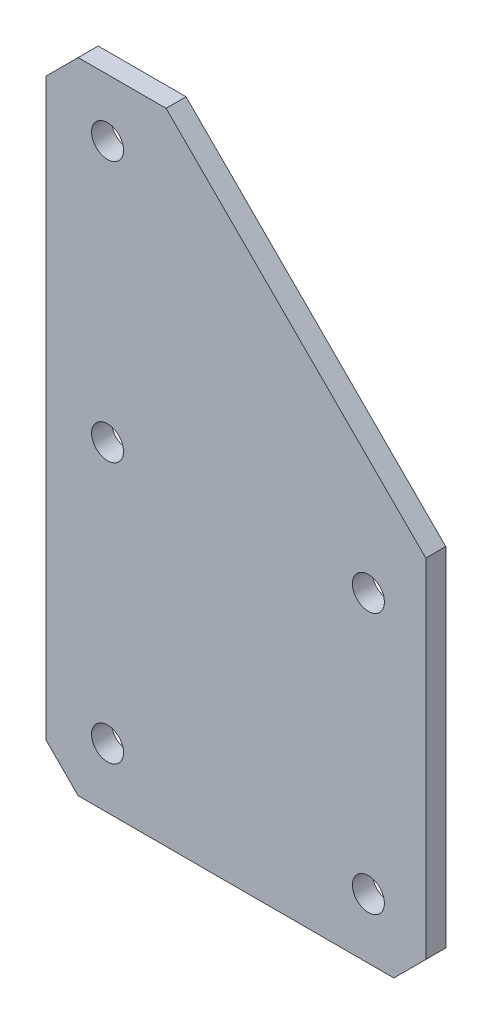
ISO-10303-21;
HEADER;
FILE_DESCRIPTION(('STEP AP214'),'2;1');
FILE_NAME('part.step','',(''),(''),'','','');
FILE_SCHEMA(('AUTOMOTIVE_DESIGN { 1 0 10303 214 1 1 1 1 }'));
ENDSEC;
DATA;
#1=APPLICATION_CONTEXT('core data for automotive mechanical design processes');
#2=APPLICATION_PROTOCOL_DEFINITION('international standard','automotive_design',2000,#1);
#3=PRODUCT_CONTEXT('',#1,'mechanical');
#4=PRODUCT('Part','Part','',(#3));
#5=PRODUCT_RELATED_PRODUCT_CATEGORY('part','',(#4));
#6=PRODUCT_DEFINITION_FORMATION('','',#4);
#7=PRODUCT_DEFINITION_CONTEXT('part definition',#1,'design');
#8=PRODUCT_DEFINITION('design','',#6,#7);
#9=PRODUCT_DEFINITION_SHAPE('','',#8);
#10=(LENGTH_UNIT() NAMED_UNIT(*) SI_UNIT(.MILLI.,.METRE.));
#11=(NAMED_UNIT(*) PLANE_ANGLE_UNIT() SI_UNIT($,.RADIAN.));
#12=(NAMED_UNIT(*) SI_UNIT($,.STERADIAN.) SOLID_ANGLE_UNIT());
#13=UNCERTAINTY_MEASURE_WITH_UNIT(LENGTH_MEASURE(1.E-05),#10,'distance_accuracy_value','');
#14=(GEOMETRIC_REPRESENTATION_CONTEXT(3) GLOBAL_UNCERTAINTY_ASSIGNED_CONTEXT((#13)) GLOBAL_UNIT_ASSIGNED_CONTEXT((#10,
#11,#12)) REPRESENTATION_CONTEXT('',''));
#15=CARTESIAN_POINT('',(0.,0.,0.));
#16=DIRECTION('',(0.,0.,1.));
#17=DIRECTION('',(1.,0.,0.));
#18=AXIS2_PLACEMENT_3D('',#15,#16,#17);
#19=CARTESIAN_POINT('',(-95.3643561974927,112.075976437154,3.175));
#20=DIRECTION('',(1.,0.,0.));
#21=DIRECTION('',(0.,0.,-1.));
#22=AXIS2_PLACEMENT_3D('',#19,#20,#21);
#23=PLANE('',#22);
#24=DIRECTION('',(0.,-1.,0.));
#25=VECTOR('',#24,1.);
#26=CARTESIAN_POINT('',(-95.3643561974927,112.075976437154,3.175));
#27=LINE('',#26,#25);
#28=CARTESIAN_POINT('',(-95.3643561974927,106.995976437154,3.175));
#29=VERTEX_POINT('',#28);
#30=CARTESIAN_POINT('',(-95.3643561974927,15.5559764371544,3.175));
#31=VERTEX_POINT('',#30);
#32=EDGE_CURVE('E166',#29,#31,#27,.T.);
#33=ORIENTED_EDGE('',*,*,#32,.F.);
#34=DIRECTION('',(0.,0.,-1.));
#35=VECTOR('',#34,1.);
#36=CARTESIAN_POINT('',(-95.3643561974927,106.995976437154,3.175));
#37=LINE('',#36,#35);
#38=CARTESIAN_POINT('',(-95.3643561974927,106.995976437154,0.));
#39=VERTEX_POINT('',#38);
#40=EDGE_CURVE('E170',#29,#39,#37,.T.);
#41=ORIENTED_EDGE('',*,*,#40,.T.);
#42=DIRECTION('',(0.,-1.,0.));
#43=VECTOR('',#42,1.);
#44=CARTESIAN_POINT('',(-95.3643561974927,112.075976437154,0.));
#45=LINE('',#44,#43);
#46=CARTESIAN_POINT('',(-95.3643561974927,15.5559764371544,0.));
#47=VERTEX_POINT('',#46);
#48=EDGE_CURVE('E150',#39,#47,#45,.T.);
#49=ORIENTED_EDGE('',*,*,#48,.T.);
#50=DIRECTION('',(0.,0.,1.));
#51=VECTOR('',#50,1.);
#52=CARTESIAN_POINT('',(-95.3643561974927,15.5559764371544,3.175));
#53=LINE('',#52,#51);
#54=EDGE_CURVE('E136',#47,#31,#53,.T.);
#55=ORIENTED_EDGE('',*,*,#54,.T.);
#56=EDGE_LOOP('',(#33,#41,#49,#55));
#57=FACE_BOUND('',#56,.T.);
#58=ADVANCED_FACE('F39',(#57),#23,.F.);
#59=CARTESIAN_POINT('',(-95.3643561974927,10.4759764371543,3.175));
#60=DIRECTION('',(0.,1.,0.));
#61=DIRECTION('',(0.,0.,1.));
#62=AXIS2_PLACEMENT_3D('',#59,#60,#61);
#63=PLANE('',#62);
#64=DIRECTION('',(1.,0.,0.));
#65=VECTOR('',#64,1.);
#66=CARTESIAN_POINT('',(-95.3643561974927,10.4759764371543,3.175));
#67=LINE('',#66,#65);
#68=CARTESIAN_POINT('',(-90.2843561974927,10.4759764371543,3.175));
#69=VERTEX_POINT('',#68);
#70=CARTESIAN_POINT('',(-40.1193561974927,10.4759764371543,3.175));
#71=VERTEX_POINT('',#70);
#72=EDGE_CURVE('E126',#69,#71,#67,.T.);
#73=ORIENTED_EDGE('',*,*,#72,.F.);
#74=DIRECTION('',(0.,0.,-1.));
#75=VECTOR('',#74,1.);
#76=CARTESIAN_POINT('',(-90.2843561974927,10.4759764371543,3.175));
#77=LINE('',#76,#75);
#78=CARTESIAN_POINT('',(-90.2843561974927,10.4759764371543,0.));
#79=VERTEX_POINT('',#78);
#80=EDGE_CURVE('E48',#69,#79,#77,.T.);
#81=ORIENTED_EDGE('',*,*,#80,.T.);
#82=DIRECTION('',(1.,0.,0.));
#83=VECTOR('',#82,1.);
#84=CARTESIAN_POINT('',(-95.3643561974927,10.4759764371543,0.));
#85=LINE('',#84,#83);
#86=CARTESIAN_POINT('',(-40.1193561974927,10.4759764371543,0.));
#87=VERTEX_POINT('',#86);
#88=EDGE_CURVE('E154',#79,#87,#85,.T.);
#89=ORIENTED_EDGE('',*,*,#88,.T.);
#90=DIRECTION('',(0.,0.,1.));
#91=VECTOR('',#90,1.);
#92=CARTESIAN_POINT('',(-40.1193561974927,10.4759764371543,3.175));
#93=LINE('',#92,#91);
#94=EDGE_CURVE('E68',#87,#71,#93,.T.);
#95=ORIENTED_EDGE('',*,*,#94,.T.);
#96=EDGE_LOOP('',(#73,#81,#89,#95));
#97=FACE_BOUND('',#96,.T.);
#98=ADVANCED_FACE('F196',(#97),#63,.F.);
#99=CARTESIAN_POINT('',(-35.0393561974927,70.8009764371544,3.175));
#100=DIRECTION('',(-1.,0.,0.));
#101=DIRECTION('',(0.,0.,1.));
#102=AXIS2_PLACEMENT_3D('',#99,#100,#101);
#103=PLANE('',#102);
#104=DIRECTION('',(0.,1.,0.));
#105=VECTOR('',#104,1.);
#106=CARTESIAN_POINT('',(-35.0393561974927,70.8009764371544,3.175));
#107=LINE('',#106,#105);
#108=CARTESIAN_POINT('',(-35.0393561974927,15.5559764371543,3.175));
#109=VERTEX_POINT('',#108);
#110=CARTESIAN_POINT('',(-35.0393561974927,70.8009764371544,3.175));
#111=VERTEX_POINT('',#110);
#112=EDGE_CURVE('E116',#109,#111,#107,.T.);
#113=ORIENTED_EDGE('',*,*,#112,.F.);
#114=DIRECTION('',(0.,0.,-1.));
#115=VECTOR('',#114,1.);
#116=CARTESIAN_POINT('',(-35.0393561974927,15.5559764371543,3.175));
#117=LINE('',#116,#115);
#118=CARTESIAN_POINT('',(-35.0393561974927,15.5559764371543,0.));
#119=VERTEX_POINT('',#118);
#120=EDGE_CURVE('E11',#109,#119,#117,.T.);
#121=ORIENTED_EDGE('',*,*,#120,.T.);
#122=DIRECTION('',(0.,1.,0.));
#123=VECTOR('',#122,1.);
#124=CARTESIAN_POINT('',(-35.0393561974927,70.8009764371544,0.));
#125=LINE('',#124,#123);
#126=CARTESIAN_POINT('',(-35.0393561974927,70.8009764371544,0.));
#127=VERTEX_POINT('',#126);
#128=EDGE_CURVE('E132',#119,#127,#125,.T.);
#129=ORIENTED_EDGE('',*,*,#128,.T.);
#130=DIRECTION('',(0.,0.,-1.));
#131=VECTOR('',#130,1.);
#132=CARTESIAN_POINT('',(-35.0393561974927,70.8009764371544,3.175));
#133=LINE('',#132,#131);
#134=EDGE_CURVE('E129',#111,#127,#133,.T.);
#135=ORIENTED_EDGE('',*,*,#134,.F.);
#136=EDGE_LOOP('',(#113,#121,#129,#135));
#137=FACE_BOUND('',#136,.T.);
#138=ADVANCED_FACE('F130',(#137),#103,.F.);
#139=CARTESIAN_POINT('',(-35.0393561974927,70.8009764371544,3.175));
#140=DIRECTION('',(-0.707106781186547,-0.707106781186548,0.));
#141=DIRECTION('',(0.707106781186548,-0.707106781186547,0.));
#142=AXIS2_PLACEMENT_3D('',#139,#140,#141);
#143=PLANE('',#142);
#144=DIRECTION('',(-0.707106781186548,0.707106781186548,0.));
#145=VECTOR('',#144,1.);
#146=CARTESIAN_POINT('',(-35.0393561974927,70.8009764371544,0.));
#147=LINE('',#146,#145);
#148=CARTESIAN_POINT('',(-76.3143561974927,112.075976437154,0.));
#149=VERTEX_POINT('',#148);
#150=EDGE_CURVE('E160',#127,#149,#147,.T.);
#151=ORIENTED_EDGE('',*,*,#150,.T.);
#152=DIRECTION('',(0.,0.,-1.));
#153=VECTOR('',#152,1.);
#154=CARTESIAN_POINT('',(-76.3143561974927,112.075976437154,3.175));
#155=LINE('',#154,#153);
#156=CARTESIAN_POINT('',(-76.3143561974927,112.075976437154,3.175));
#157=VERTEX_POINT('',#156);
#158=EDGE_CURVE('E137',#157,#149,#155,.T.);
#159=ORIENTED_EDGE('',*,*,#158,.F.);
#160=DIRECTION('',(-0.707106781186548,0.707106781186548,0.));
#161=VECTOR('',#160,1.);
#162=CARTESIAN_POINT('',(-35.0393561974927,70.8009764371544,3.175));
#163=LINE('',#162,#161);
#164=EDGE_CURVE('E121',#111,#157,#163,.T.);
#165=ORIENTED_EDGE('',*,*,#164,.F.);
#166=ORIENTED_EDGE('',*,*,#134,.T.);
#167=EDGE_LOOP('',(#151,#159,#165,#166));
#168=FACE_BOUND('',#167,.T.);
#169=ADVANCED_FACE('F139',(#168),#143,.F.);
#170=CARTESIAN_POINT('',(-95.3643561974927,112.075976437154,3.175));
#171=DIRECTION('',(0.,-1.,0.));
#172=DIRECTION('',(0.,0.,-1.));
#173=AXIS2_PLACEMENT_3D('',#170,#171,#172);
#174=PLANE('',#173);
#175=DIRECTION('',(-1.,0.,0.));
#176=VECTOR('',#175,1.);
#177=CARTESIAN_POINT('',(-95.3643561974927,112.075976437154,0.));
#178=LINE('',#177,#176);
#179=CARTESIAN_POINT('',(-90.2843561974927,112.075976437154,0.));
#180=VERTEX_POINT('',#179);
#181=EDGE_CURVE('E162',#149,#180,#178,.T.);
#182=ORIENTED_EDGE('',*,*,#181,.T.);
#183=DIRECTION('',(0.,0.,1.));
#184=VECTOR('',#183,1.);
#185=CARTESIAN_POINT('',(-90.2843561974927,112.075976437154,3.175));
#186=LINE('',#185,#184);
#187=CARTESIAN_POINT('',(-90.2843561974927,112.075976437154,3.175));
#188=VERTEX_POINT('',#187);
#189=EDGE_CURVE('E182',#180,#188,#186,.T.);
#190=ORIENTED_EDGE('',*,*,#189,.T.);
#191=DIRECTION('',(-1.,0.,0.));
#192=VECTOR('',#191,1.);
#193=CARTESIAN_POINT('',(-95.3643561974927,112.075976437154,3.175));
#194=LINE('',#193,#192);
#195=EDGE_CURVE('E143',#157,#188,#194,.T.);
#196=ORIENTED_EDGE('',*,*,#195,.F.);
#197=ORIENTED_EDGE('',*,*,#158,.T.);
#198=EDGE_LOOP('',(#182,#190,#196,#197));
#199=FACE_BOUND('',#198,.T.);
#200=ADVANCED_FACE('F307',(#199),#174,.F.);
#201=CARTESIAN_POINT('',(0.,0.,3.175));
#202=DIRECTION('',(0.,0.,1.));
#203=DIRECTION('',(1.,0.,0.));
#204=AXIS2_PLACEMENT_3D('',#201,#202,#203);
#205=PLANE('',#204);
#206=CARTESIAN_POINT('',(-44.1627342757908,61.4553628301755,3.175));
#207=DIRECTION('',(0.,0.,-1.));
#208=DIRECTION('',(-1.,0.,0.));
#209=AXIS2_PLACEMENT_3D('',#206,#207,#208);
#210=CIRCLE('',#209,2.54);
#211=CARTESIAN_POINT('',(-46.7027342757908,61.4553628301755,3.175));
#212=VERTEX_POINT('',#211);
#213=EDGE_CURVE('E263',#212,#212,#210,.T.);
#214=ORIENTED_EDGE('',*,*,#213,.T.);
#215=EDGE_LOOP('',(#214));
#216=FACE_BOUND('',#215,.T.);
#217=CARTESIAN_POINT('',(-85.617120668812,102.909749223197,3.175));
#218=DIRECTION('',(0.,0.,-1.));
#219=DIRECTION('',(-1.,0.,0.));
#220=AXIS2_PLACEMENT_3D('',#217,#218,#219);
#221=CIRCLE('',#220,2.53999999999999);
#222=CARTESIAN_POINT('',(-88.157120668812,102.909749223197,3.175));
#223=VERTEX_POINT('',#222);
#224=EDGE_CURVE('E251',#223,#223,#221,.T.);
#225=ORIENTED_EDGE('',*,*,#224,.T.);
#226=EDGE_LOOP('',(#225));
#227=FACE_BOUND('',#226,.T.);
#228=CARTESIAN_POINT('',(-85.617120668812,61.4553628301755,3.175));
#229=DIRECTION('',(0.,0.,-1.));
#230=DIRECTION('',(-1.,0.,0.));
#231=AXIS2_PLACEMENT_3D('',#228,#229,#230);
#232=CIRCLE('',#231,2.54);
#233=CARTESIAN_POINT('',(-88.157120668812,61.4553628301755,3.175));
#234=VERTEX_POINT('',#233);
#235=EDGE_CURVE('E250',#234,#234,#232,.T.);
#236=ORIENTED_EDGE('',*,*,#235,.T.);
#237=EDGE_LOOP('',(#236));
#238=FACE_BOUND('',#237,.T.);
#239=CARTESIAN_POINT('',(-85.617120668812,20.0009764371543,3.175));
#240=DIRECTION('',(0.,0.,-1.));
#241=DIRECTION('',(-1.,0.,0.));
#242=AXIS2_PLACEMENT_3D('',#239,#240,#241);
#243=CIRCLE('',#242,2.54);
#244=CARTESIAN_POINT('',(-88.157120668812,20.0009764371543,3.175));
#245=VERTEX_POINT('',#244);
#246=EDGE_CURVE('E242',#245,#245,#243,.T.);
#247=ORIENTED_EDGE('',*,*,#246,.T.);
#248=EDGE_LOOP('',(#247));
#249=FACE_BOUND('',#248,.T.);
#250=CARTESIAN_POINT('',(-44.1627342757908,20.0009764371543,3.175));
#251=DIRECTION('',(0.,0.,-1.));
#252=DIRECTION('',(-1.,0.,0.));
#253=AXIS2_PLACEMENT_3D('',#250,#251,#252);
#254=CIRCLE('',#253,2.54);
#255=CARTESIAN_POINT('',(-46.7027342757908,20.0009764371543,3.175));
#256=VERTEX_POINT('',#255);
#257=EDGE_CURVE('E155',#256,#256,#254,.T.);
#258=ORIENTED_EDGE('',*,*,#257,.T.);
#259=EDGE_LOOP('',(#258));
#260=FACE_BOUND('',#259,.T.);
#261=ORIENTED_EDGE('',*,*,#195,.T.);
#262=DIRECTION('',(0.707106781186549,0.707106781186547,0.));
#263=VECTOR('',#262,1.);
#264=CARTESIAN_POINT('',(-101.180166317323,101.180166317324,3.175));
#265=LINE('',#264,#263);
#266=EDGE_CURVE('E189',#188,#29,#265,.F.);
#267=ORIENTED_EDGE('',*,*,#266,.T.);
#268=ORIENTED_EDGE('',*,*,#32,.T.);
#269=DIRECTION('',(-0.707106781186546,0.707106781186549,0.));
#270=VECTOR('',#269,1.);
#271=CARTESIAN_POINT('',(-39.9041898801693,-39.9041898801692,3.175));
#272=LINE('',#271,#270);
#273=EDGE_CURVE('E187',#31,#69,#272,.F.);
#274=ORIENTED_EDGE('',*,*,#273,.T.);
#275=ORIENTED_EDGE('',*,*,#72,.T.);
#276=DIRECTION('',(-0.707106781186548,-0.707106781186547,0.));
#277=VECTOR('',#276,1.);
#278=CARTESIAN_POINT('',(-25.2976663173235,25.2976663173235,3.175));
#279=LINE('',#278,#277);
#280=EDGE_CURVE('E58',#71,#109,#279,.F.);
#281=ORIENTED_EDGE('',*,*,#280,.T.);
#282=ORIENTED_EDGE('',*,*,#112,.T.);
#283=ORIENTED_EDGE('',*,*,#164,.T.);
#284=EDGE_LOOP('',(#261,#267,#268,#274,#275,#281,#282,#283));
#285=FACE_BOUND('',#284,.T.);
#286=ADVANCED_FACE('F119',(#216,#227,#238,#249,#260,#285),#205,.T.);
#287=CARTESIAN_POINT('',(0.,0.,0.));
#288=DIRECTION('',(0.,0.,1.));
#289=DIRECTION('',(1.,0.,0.));
#290=AXIS2_PLACEMENT_3D('',#287,#288,#289);
#291=PLANE('',#290);
#292=CARTESIAN_POINT('',(-44.1627342757908,61.4553628301755,0.));
#293=DIRECTION('',(0.,0.,-1.));
#294=DIRECTION('',(-1.,0.,0.));
#295=AXIS2_PLACEMENT_3D('',#292,#293,#294);
#296=CIRCLE('',#295,2.54);
#297=CARTESIAN_POINT('',(-46.7027342757908,61.4553628301755,0.));
#298=VERTEX_POINT('',#297);
#299=EDGE_CURVE('E260',#298,#298,#296,.T.);
#300=ORIENTED_EDGE('',*,*,#299,.F.);
#301=EDGE_LOOP('',(#300));
#302=FACE_BOUND('',#301,.T.);
#303=CARTESIAN_POINT('',(-85.617120668812,102.909749223197,0.));
#304=DIRECTION('',(0.,0.,-1.));
#305=DIRECTION('',(-1.,0.,0.));
#306=AXIS2_PLACEMENT_3D('',#303,#304,#305);
#307=CIRCLE('',#306,2.53999999999999);
#308=CARTESIAN_POINT('',(-88.157120668812,102.909749223197,0.));
#309=VERTEX_POINT('',#308);
#310=EDGE_CURVE('E267',#309,#309,#307,.T.);
#311=ORIENTED_EDGE('',*,*,#310,.F.);
#312=EDGE_LOOP('',(#311));
#313=FACE_BOUND('',#312,.T.);
#314=CARTESIAN_POINT('',(-85.617120668812,61.4553628301755,0.));
#315=DIRECTION('',(0.,0.,-1.));
#316=DIRECTION('',(-1.,0.,0.));
#317=AXIS2_PLACEMENT_3D('',#314,#315,#316);
#318=CIRCLE('',#317,2.54);
#319=CARTESIAN_POINT('',(-88.157120668812,61.4553628301755,0.));
#320=VERTEX_POINT('',#319);
#321=EDGE_CURVE('E246',#320,#320,#318,.T.);
#322=ORIENTED_EDGE('',*,*,#321,.F.);
#323=EDGE_LOOP('',(#322));
#324=FACE_BOUND('',#323,.T.);
#325=CARTESIAN_POINT('',(-85.617120668812,20.0009764371543,0.));
#326=DIRECTION('',(0.,0.,-1.));
#327=DIRECTION('',(-1.,0.,0.));
#328=AXIS2_PLACEMENT_3D('',#325,#326,#327);
#329=CIRCLE('',#328,2.54);
#330=CARTESIAN_POINT('',(-88.157120668812,20.0009764371543,0.));
#331=VERTEX_POINT('',#330);
#332=EDGE_CURVE('E255',#331,#331,#329,.T.);
#333=ORIENTED_EDGE('',*,*,#332,.F.);
#334=EDGE_LOOP('',(#333));
#335=FACE_BOUND('',#334,.T.);
#336=CARTESIAN_POINT('',(-44.1627342757908,20.0009764371543,0.));
#337=DIRECTION('',(0.,0.,-1.));
#338=DIRECTION('',(-1.,0.,0.));
#339=AXIS2_PLACEMENT_3D('',#336,#337,#338);
#340=CIRCLE('',#339,2.54);
#341=CARTESIAN_POINT('',(-46.7027342757908,20.0009764371543,0.));
#342=VERTEX_POINT('',#341);
#343=EDGE_CURVE('E238',#342,#342,#340,.T.);
#344=ORIENTED_EDGE('',*,*,#343,.F.);
#345=EDGE_LOOP('',(#344));
#346=FACE_BOUND('',#345,.T.);
#347=ORIENTED_EDGE('',*,*,#48,.F.);
#348=DIRECTION('',(-0.707106781186549,-0.707106781186547,0.));
#349=VECTOR('',#348,1.);
#350=CARTESIAN_POINT('',(-95.3643561974927,106.995976437154,0.));
#351=LINE('',#350,#349);
#352=EDGE_CURVE('E179',#39,#180,#351,.F.);
#353=ORIENTED_EDGE('',*,*,#352,.T.);
#354=ORIENTED_EDGE('',*,*,#181,.F.);
#355=ORIENTED_EDGE('',*,*,#150,.F.);
#356=ORIENTED_EDGE('',*,*,#128,.F.);
#357=DIRECTION('',(0.707106781186548,0.707106781186547,0.));
#358=VECTOR('',#357,1.);
#359=CARTESIAN_POINT('',(-35.0393561974927,15.5559764371543,0.));
#360=LINE('',#359,#358);
#361=EDGE_CURVE('E174',#119,#87,#360,.F.);
#362=ORIENTED_EDGE('',*,*,#361,.T.);
#363=ORIENTED_EDGE('',*,*,#88,.F.);
#364=DIRECTION('',(0.707106781186546,-0.707106781186549,0.));
#365=VECTOR('',#364,1.);
#366=CARTESIAN_POINT('',(-90.2843561974927,10.4759764371543,0.));
#367=LINE('',#366,#365);
#368=EDGE_CURVE('E177',#79,#47,#367,.F.);
#369=ORIENTED_EDGE('',*,*,#368,.T.);
#370=EDGE_LOOP('',(#347,#353,#354,#355,#356,#362,#363,#369));
#371=FACE_BOUND('',#370,.T.);
#372=ADVANCED_FACE('F201',(#302,#313,#324,#335,#346,#371),#291,.F.);
#373=CARTESIAN_POINT('',(-44.1627342757908,20.0009764371543,3.175));
#374=DIRECTION('',(0.,0.,-1.));
#375=DIRECTION('',(-1.,0.,0.));
#376=AXIS2_PLACEMENT_3D('',#373,#374,#375);
#377=CYLINDRICAL_SURFACE('',#376,2.54);
#378=ORIENTED_EDGE('',*,*,#257,.F.);
#379=EDGE_LOOP('',(#378));
#380=FACE_BOUND('',#379,.T.);
#381=ORIENTED_EDGE('',*,*,#343,.T.);
#382=EDGE_LOOP('',(#381));
#383=FACE_BOUND('',#382,.T.);
#384=ADVANCED_FACE('F285',(#380,#383),#377,.F.);
#385=CARTESIAN_POINT('',(-85.617120668812,20.0009764371543,3.175));
#386=DIRECTION('',(0.,0.,-1.));
#387=DIRECTION('',(-1.,0.,0.));
#388=AXIS2_PLACEMENT_3D('',#385,#386,#387);
#389=CYLINDRICAL_SURFACE('',#388,2.54);
#390=ORIENTED_EDGE('',*,*,#246,.F.);
#391=EDGE_LOOP('',(#390));
#392=FACE_BOUND('',#391,.T.);
#393=ORIENTED_EDGE('',*,*,#332,.T.);
#394=EDGE_LOOP('',(#393));
#395=FACE_BOUND('',#394,.T.);
#396=ADVANCED_FACE('F295',(#392,#395),#389,.F.);
#397=CARTESIAN_POINT('',(-85.617120668812,61.4553628301755,3.175));
#398=DIRECTION('',(0.,0.,-1.));
#399=DIRECTION('',(-1.,0.,0.));
#400=AXIS2_PLACEMENT_3D('',#397,#398,#399);
#401=CYLINDRICAL_SURFACE('',#400,2.54);
#402=ORIENTED_EDGE('',*,*,#235,.F.);
#403=EDGE_LOOP('',(#402));
#404=FACE_BOUND('',#403,.T.);
#405=ORIENTED_EDGE('',*,*,#321,.T.);
#406=EDGE_LOOP('',(#405));
#407=FACE_BOUND('',#406,.T.);
#408=ADVANCED_FACE('F279',(#404,#407),#401,.F.);
#409=CARTESIAN_POINT('',(-85.617120668812,102.909749223197,3.175));
#410=DIRECTION('',(0.,0.,-1.));
#411=DIRECTION('',(-1.,0.,0.));
#412=AXIS2_PLACEMENT_3D('',#409,#410,#411);
#413=CYLINDRICAL_SURFACE('',#412,2.53999999999999);
#414=ORIENTED_EDGE('',*,*,#224,.F.);
#415=EDGE_LOOP('',(#414));
#416=FACE_BOUND('',#415,.T.);
#417=ORIENTED_EDGE('',*,*,#310,.T.);
#418=EDGE_LOOP('',(#417));
#419=FACE_BOUND('',#418,.T.);
#420=ADVANCED_FACE('F225',(#416,#419),#413,.F.);
#421=CARTESIAN_POINT('',(-44.1627342757908,61.4553628301755,3.175));
#422=DIRECTION('',(0.,0.,-1.));
#423=DIRECTION('',(-1.,0.,0.));
#424=AXIS2_PLACEMENT_3D('',#421,#422,#423);
#425=CYLINDRICAL_SURFACE('',#424,2.54);
#426=ORIENTED_EDGE('',*,*,#213,.F.);
#427=EDGE_LOOP('',(#426));
#428=FACE_BOUND('',#427,.T.);
#429=ORIENTED_EDGE('',*,*,#299,.T.);
#430=EDGE_LOOP('',(#429));
#431=FACE_BOUND('',#430,.T.);
#432=ADVANCED_FACE('F220',(#428,#431),#425,.F.);
#433=CARTESIAN_POINT('',(-95.3643561974927,106.995976437154,3.175));
#434=DIRECTION('',(0.707106781186546,-0.707106781186548,0.));
#435=DIRECTION('',(0.,0.,-1.));
#436=AXIS2_PLACEMENT_3D('',#433,#434,#435);
#437=PLANE('',#436);
#438=ORIENTED_EDGE('',*,*,#266,.F.);
#439=ORIENTED_EDGE('',*,*,#189,.F.);
#440=ORIENTED_EDGE('',*,*,#352,.F.);
#441=ORIENTED_EDGE('',*,*,#40,.F.);
#442=EDGE_LOOP('',(#438,#439,#440,#441));
#443=FACE_BOUND('',#442,.T.);
#444=ADVANCED_FACE('F208',(#443),#437,.F.);
#445=CARTESIAN_POINT('',(-90.2843561974927,10.4759764371543,3.175));
#446=DIRECTION('',(0.707106781186549,0.707106781186546,0.));
#447=DIRECTION('',(0.,0.,-1.));
#448=AXIS2_PLACEMENT_3D('',#445,#446,#447);
#449=PLANE('',#448);
#450=ORIENTED_EDGE('',*,*,#273,.F.);
#451=ORIENTED_EDGE('',*,*,#54,.F.);
#452=ORIENTED_EDGE('',*,*,#368,.F.);
#453=ORIENTED_EDGE('',*,*,#80,.F.);
#454=EDGE_LOOP('',(#450,#451,#452,#453));
#455=FACE_BOUND('',#454,.T.);
#456=ADVANCED_FACE('F204',(#455),#449,.F.);
#457=CARTESIAN_POINT('',(-35.0393561974927,15.5559764371543,3.175));
#458=DIRECTION('',(-0.707106781186547,0.707106781186548,0.));
#459=DIRECTION('',(0.,0.,-1.));
#460=AXIS2_PLACEMENT_3D('',#457,#458,#459);
#461=PLANE('',#460);
#462=ORIENTED_EDGE('',*,*,#280,.F.);
#463=ORIENTED_EDGE('',*,*,#94,.F.);
#464=ORIENTED_EDGE('',*,*,#361,.F.);
#465=ORIENTED_EDGE('',*,*,#120,.F.);
#466=EDGE_LOOP('',(#462,#463,#464,#465));
#467=FACE_BOUND('',#466,.T.);
#468=ADVANCED_FACE('F41',(#467),#461,.F.);
#469=CLOSED_SHELL('',(#58,#98,#138,#169,#200,#286,#372,#384,#396,#408,#420,#432,#444,#456,#468));
#470=MANIFOLD_SOLID_BREP('B2',#469);
#471=ADVANCED_BREP_SHAPE_REPRESENTATION('',(#18,#470),#14);
#472=SHAPE_DEFINITION_REPRESENTATION(#9,#471);
ENDSEC;
END-ISO-10303-21;
